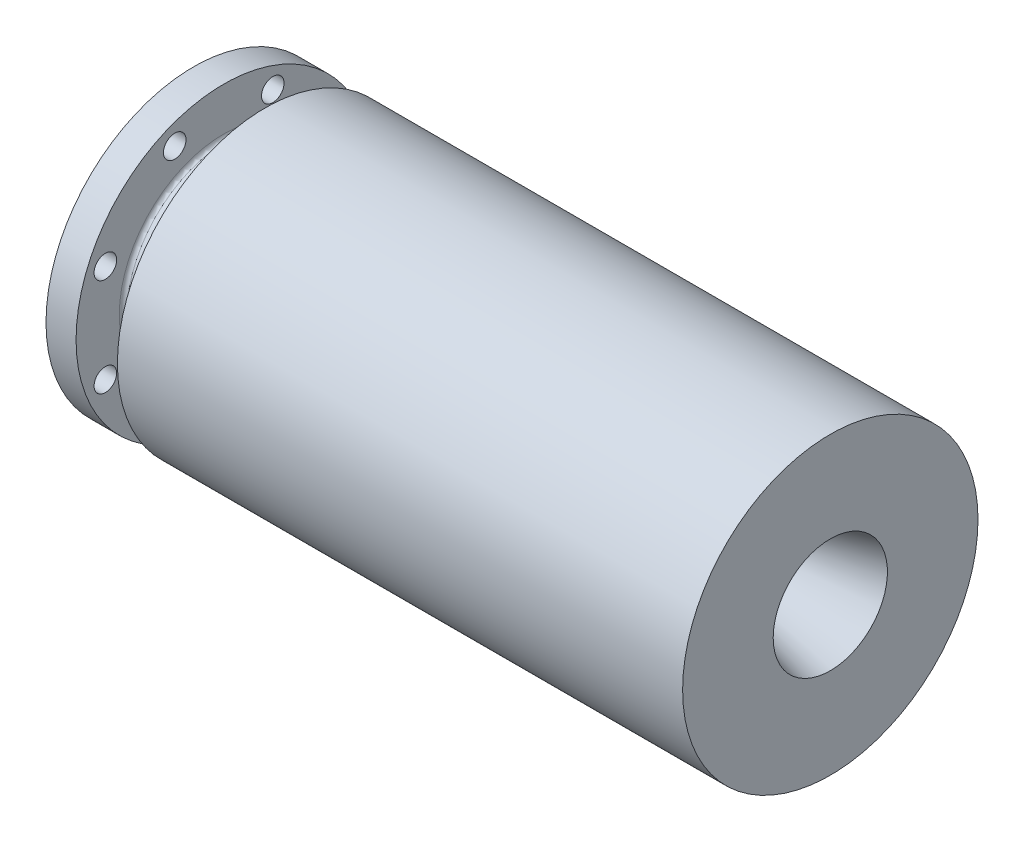
ISO-10303-21;
HEADER;
FILE_DESCRIPTION(('STEP AP214'),'2;1');
FILE_NAME('part.step','',(''),(''),'','','');
FILE_SCHEMA(('AUTOMOTIVE_DESIGN { 1 0 10303 214 1 1 1 1 }'));
ENDSEC;
DATA;
#1=APPLICATION_CONTEXT('core data for automotive mechanical design processes');
#2=APPLICATION_PROTOCOL_DEFINITION('international standard','automotive_design',2000,#1);
#3=PRODUCT_CONTEXT('',#1,'mechanical');
#4=PRODUCT('Part','Part','',(#3));
#5=PRODUCT_RELATED_PRODUCT_CATEGORY('part','',(#4));
#6=PRODUCT_DEFINITION_FORMATION('','',#4);
#7=PRODUCT_DEFINITION_CONTEXT('part definition',#1,'design');
#8=PRODUCT_DEFINITION('design','',#6,#7);
#9=PRODUCT_DEFINITION_SHAPE('','',#8);
#10=(LENGTH_UNIT() NAMED_UNIT(*) SI_UNIT(.MILLI.,.METRE.));
#11=(NAMED_UNIT(*) PLANE_ANGLE_UNIT() SI_UNIT($,.RADIAN.));
#12=(NAMED_UNIT(*) SI_UNIT($,.STERADIAN.) SOLID_ANGLE_UNIT());
#13=UNCERTAINTY_MEASURE_WITH_UNIT(LENGTH_MEASURE(1.E-05),#10,'distance_accuracy_value','');
#14=(GEOMETRIC_REPRESENTATION_CONTEXT(3) GLOBAL_UNCERTAINTY_ASSIGNED_CONTEXT((#13)) GLOBAL_UNIT_ASSIGNED_CONTEXT((#10,
#11,#12)) REPRESENTATION_CONTEXT('',''));
#15=CARTESIAN_POINT('',(0.,0.,0.));
#16=DIRECTION('',(0.,0.,1.));
#17=DIRECTION('',(1.,0.,0.));
#18=AXIS2_PLACEMENT_3D('',#15,#16,#17);
#19=CARTESIAN_POINT('',(0.,0.,0.));
#20=DIRECTION('',(-1.,0.,0.));
#21=DIRECTION('',(0.,0.,1.));
#22=AXIS2_PLACEMENT_3D('',#19,#20,#21);
#23=CYLINDRICAL_SURFACE('',#22,34.036);
#24=CARTESIAN_POINT('',(22.86,0.,0.));
#25=DIRECTION('',(1.,0.,0.));
#26=DIRECTION('',(0.,0.,-1.));
#27=AXIS2_PLACEMENT_3D('',#24,#25,#26);
#28=CIRCLE('',#27,34.036);
#29=CARTESIAN_POINT('',(22.86,0.,-34.036));
#30=VERTEX_POINT('',#29);
#31=EDGE_CURVE('E60',#30,#30,#28,.F.);
#32=ORIENTED_EDGE('',*,*,#31,.T.);
#33=EDGE_LOOP('',(#32));
#34=FACE_BOUND('',#33,.T.);
#35=CARTESIAN_POINT('',(11.43,0.,0.));
#36=DIRECTION('',(-1.,0.,0.));
#37=DIRECTION('',(0.,0.,1.));
#38=AXIS2_PLACEMENT_3D('',#35,#36,#37);
#39=CIRCLE('',#38,34.036);
#40=CARTESIAN_POINT('',(11.43,0.,34.036));
#41=VERTEX_POINT('',#40);
#42=EDGE_CURVE('E63',#41,#41,#39,.F.);
#43=ORIENTED_EDGE('',*,*,#42,.T.);
#44=EDGE_LOOP('',(#43));
#45=FACE_BOUND('',#44,.T.);
#46=ADVANCED_FACE('F34',(#34,#45),#23,.T.);
#47=CARTESIAN_POINT('',(10.16,49.911,0.));
#48=DIRECTION('',(-1.,0.,0.));
#49=DIRECTION('',(0.,0.,1.));
#50=AXIS2_PLACEMENT_3D('',#47,#48,#49);
#51=PLANE('',#50);
#52=CARTESIAN_POINT('',(10.16,40.0104509144663,16.572871405435));
#53=DIRECTION('',(-1.,0.,0.));
#54=DIRECTION('',(0.,0.,1.));
#55=AXIS2_PLACEMENT_3D('',#52,#53,#54);
#56=CIRCLE('',#55,3.81);
#57=CARTESIAN_POINT('',(10.16,40.0104509144663,20.382871405435));
#58=VERTEX_POINT('',#57);
#59=EDGE_CURVE('E103',#58,#58,#56,.F.);
#60=ORIENTED_EDGE('',*,*,#59,.F.);
#61=EDGE_LOOP('',(#60));
#62=FACE_BOUND('',#61,.T.);
#63=CARTESIAN_POINT('',(10.16,16.5728714054348,40.0104509144664));
#64=DIRECTION('',(-1.,0.,0.));
#65=DIRECTION('',(0.,0.,1.));
#66=AXIS2_PLACEMENT_3D('',#63,#64,#65);
#67=CIRCLE('',#66,3.81);
#68=CARTESIAN_POINT('',(10.16,16.5728714054348,43.8204509144664));
#69=VERTEX_POINT('',#68);
#70=EDGE_CURVE('E139',#69,#69,#67,.F.);
#71=ORIENTED_EDGE('',*,*,#70,.F.);
#72=EDGE_LOOP('',(#71));
#73=FACE_BOUND('',#72,.T.);
#74=CARTESIAN_POINT('',(10.16,-16.5728714054351,40.0104509144662));
#75=DIRECTION('',(-1.,0.,0.));
#76=DIRECTION('',(0.,0.,1.));
#77=AXIS2_PLACEMENT_3D('',#74,#75,#76);
#78=CIRCLE('',#77,3.81);
#79=CARTESIAN_POINT('',(10.16,-16.5728714054351,43.8204509144662));
#80=VERTEX_POINT('',#79);
#81=EDGE_CURVE('E133',#80,#80,#78,.F.);
#82=ORIENTED_EDGE('',*,*,#81,.F.);
#83=EDGE_LOOP('',(#82));
#84=FACE_BOUND('',#83,.T.);
#85=CARTESIAN_POINT('',(10.16,-40.0104509144663,16.572871405435));
#86=DIRECTION('',(-1.,0.,0.));
#87=DIRECTION('',(0.,0.,1.));
#88=AXIS2_PLACEMENT_3D('',#85,#86,#87);
#89=CIRCLE('',#88,3.81);
#90=CARTESIAN_POINT('',(10.16,-40.0104509144663,20.382871405435));
#91=VERTEX_POINT('',#90);
#92=EDGE_CURVE('E127',#91,#91,#89,.F.);
#93=ORIENTED_EDGE('',*,*,#92,.F.);
#94=EDGE_LOOP('',(#93));
#95=FACE_BOUND('',#94,.T.);
#96=CARTESIAN_POINT('',(10.16,-40.0104509144662,-16.5728714054353));
#97=DIRECTION('',(-1.,0.,0.));
#98=DIRECTION('',(0.,0.,1.));
#99=AXIS2_PLACEMENT_3D('',#96,#97,#98);
#100=CIRCLE('',#99,3.81);
#101=CARTESIAN_POINT('',(10.16,-40.0104509144662,-12.7628714054353));
#102=VERTEX_POINT('',#101);
#103=EDGE_CURVE('E121',#102,#102,#100,.F.);
#104=ORIENTED_EDGE('',*,*,#103,.F.);
#105=EDGE_LOOP('',(#104));
#106=FACE_BOUND('',#105,.T.);
#107=CARTESIAN_POINT('',(10.16,-16.5728714054346,-40.0104509144665));
#108=DIRECTION('',(-1.,0.,0.));
#109=DIRECTION('',(0.,0.,1.));
#110=AXIS2_PLACEMENT_3D('',#107,#108,#109);
#111=CIRCLE('',#110,3.81);
#112=CARTESIAN_POINT('',(10.16,-16.5728714054346,-36.2004509144665));
#113=VERTEX_POINT('',#112);
#114=EDGE_CURVE('E115',#113,#113,#111,.F.);
#115=ORIENTED_EDGE('',*,*,#114,.F.);
#116=EDGE_LOOP('',(#115));
#117=FACE_BOUND('',#116,.T.);
#118=CARTESIAN_POINT('',(10.16,16.5728714054354,-40.0104509144661));
#119=DIRECTION('',(-1.,0.,0.));
#120=DIRECTION('',(0.,0.,1.));
#121=AXIS2_PLACEMENT_3D('',#118,#119,#120);
#122=CIRCLE('',#121,3.81);
#123=CARTESIAN_POINT('',(10.16,16.5728714054354,-36.2004509144661));
#124=VERTEX_POINT('',#123);
#125=EDGE_CURVE('E109',#124,#124,#122,.F.);
#126=ORIENTED_EDGE('',*,*,#125,.F.);
#127=EDGE_LOOP('',(#126));
#128=FACE_BOUND('',#127,.T.);
#129=CARTESIAN_POINT('',(10.16,40.0104509144663,-16.572871405435));
#130=DIRECTION('',(-1.,0.,0.));
#131=DIRECTION('',(0.,0.,1.));
#132=AXIS2_PLACEMENT_3D('',#129,#130,#131);
#133=CIRCLE('',#132,3.81);
#134=CARTESIAN_POINT('',(10.16,40.0104509144663,-12.762871405435));
#135=VERTEX_POINT('',#134);
#136=EDGE_CURVE('E99',#135,#135,#133,.F.);
#137=ORIENTED_EDGE('',*,*,#136,.F.);
#138=EDGE_LOOP('',(#137));
#139=FACE_BOUND('',#138,.T.);
#140=CARTESIAN_POINT('',(10.16,0.,0.));
#141=DIRECTION('',(-1.,0.,0.));
#142=DIRECTION('',(0.,0.,1.));
#143=AXIS2_PLACEMENT_3D('',#140,#141,#142);
#144=CIRCLE('',#143,35.306);
#145=CARTESIAN_POINT('',(10.16,0.,35.306));
#146=VERTEX_POINT('',#145);
#147=EDGE_CURVE('E54',#146,#146,#144,.T.);
#148=ORIENTED_EDGE('',*,*,#147,.T.);
#149=EDGE_LOOP('',(#148));
#150=FACE_BOUND('',#149,.T.);
#151=CARTESIAN_POINT('',(10.16,0.,0.));
#152=DIRECTION('',(-1.,0.,0.));
#153=DIRECTION('',(0.,0.,1.));
#154=AXIS2_PLACEMENT_3D('',#151,#152,#153);
#155=CIRCLE('',#154,49.911);
#156=CARTESIAN_POINT('',(10.16,0.,49.911));
#157=VERTEX_POINT('',#156);
#158=EDGE_CURVE('E66',#157,#157,#155,.T.);
#159=ORIENTED_EDGE('',*,*,#158,.F.);
#160=EDGE_LOOP('',(#159));
#161=FACE_BOUND('',#160,.T.);
#162=ADVANCED_FACE('F150',(#62,#73,#84,#95,#106,#117,#128,#139,#150,#161),#51,.F.);
#163=CARTESIAN_POINT('',(0.,0.,0.));
#164=DIRECTION('',(-1.,0.,0.));
#165=DIRECTION('',(0.,0.,1.));
#166=AXIS2_PLACEMENT_3D('',#163,#164,#165);
#167=CYLINDRICAL_SURFACE('',#166,49.911);
#168=CARTESIAN_POINT('',(0.,0.,0.));
#169=DIRECTION('',(-1.,0.,0.));
#170=DIRECTION('',(0.,0.,1.));
#171=AXIS2_PLACEMENT_3D('',#168,#169,#170);
#172=CIRCLE('',#171,49.911);
#173=CARTESIAN_POINT('',(0.,0.,49.911));
#174=VERTEX_POINT('',#173);
#175=EDGE_CURVE('E69',#174,#174,#172,.T.);
#176=ORIENTED_EDGE('',*,*,#175,.F.);
#177=EDGE_LOOP('',(#176));
#178=FACE_BOUND('',#177,.T.);
#179=ORIENTED_EDGE('',*,*,#158,.T.);
#180=EDGE_LOOP('',(#179));
#181=FACE_BOUND('',#180,.T.);
#182=ADVANCED_FACE('F153',(#178,#181),#167,.T.);
#183=CARTESIAN_POINT('',(0.,37.5666,0.));
#184=DIRECTION('',(1.,0.,0.));
#185=DIRECTION('',(0.,0.,-1.));
#186=AXIS2_PLACEMENT_3D('',#183,#184,#185);
#187=PLANE('',#186);
#188=CARTESIAN_POINT('',(0.,40.0104509144663,16.572871405435));
#189=DIRECTION('',(-1.,0.,0.));
#190=DIRECTION('',(0.,-0.707106781186549,0.707106781186546));
#191=AXIS2_PLACEMENT_3D('',#188,#189,#190);
#192=CIRCLE('',#191,3.81);
#193=CARTESIAN_POINT('',(0.,37.3163740781455,19.2669482417557));
#194=VERTEX_POINT('',#193);
#195=EDGE_CURVE('E142',#194,#194,#192,.T.);
#196=ORIENTED_EDGE('',*,*,#195,.F.);
#197=EDGE_LOOP('',(#196));
#198=FACE_BOUND('',#197,.T.);
#199=CARTESIAN_POINT('',(0.,16.5728714054348,40.0104509144664));
#200=DIRECTION('',(-1.,0.,0.));
#201=DIRECTION('',(0.,-1.,0.));
#202=AXIS2_PLACEMENT_3D('',#199,#200,#201);
#203=CIRCLE('',#202,3.81);
#204=CARTESIAN_POINT('',(0.,12.7628714054348,40.0104509144663));
#205=VERTEX_POINT('',#204);
#206=EDGE_CURVE('E136',#205,#205,#203,.T.);
#207=ORIENTED_EDGE('',*,*,#206,.F.);
#208=EDGE_LOOP('',(#207));
#209=FACE_BOUND('',#208,.T.);
#210=CARTESIAN_POINT('',(0.,-16.5728714054351,40.0104509144662));
#211=DIRECTION('',(-1.,0.,0.));
#212=DIRECTION('',(0.,-0.707106781186544,-0.707106781186551));
#213=AXIS2_PLACEMENT_3D('',#210,#211,#212);
#214=CIRCLE('',#213,3.81);
#215=CARTESIAN_POINT('',(0.,-19.2669482417559,37.3163740781455));
#216=VERTEX_POINT('',#215);
#217=EDGE_CURVE('E130',#216,#216,#214,.T.);
#218=ORIENTED_EDGE('',*,*,#217,.F.);
#219=EDGE_LOOP('',(#218));
#220=FACE_BOUND('',#219,.T.);
#221=CARTESIAN_POINT('',(0.,-40.0104509144663,16.572871405435));
#222=DIRECTION('',(-1.,0.,0.));
#223=DIRECTION('',(0.,0.,-1.));
#224=AXIS2_PLACEMENT_3D('',#221,#222,#223);
#225=CIRCLE('',#224,3.81);
#226=CARTESIAN_POINT('',(0.,-40.0104509144663,12.762871405435));
#227=VERTEX_POINT('',#226);
#228=EDGE_CURVE('E124',#227,#227,#225,.T.);
#229=ORIENTED_EDGE('',*,*,#228,.F.);
#230=EDGE_LOOP('',(#229));
#231=FACE_BOUND('',#230,.T.);
#232=CARTESIAN_POINT('',(0.,-40.0104509144662,-16.5728714054353));
#233=DIRECTION('',(-1.,0.,0.));
#234=DIRECTION('',(0.,0.707106781186554,-0.707106781186541));
#235=AXIS2_PLACEMENT_3D('',#232,#233,#234);
#236=CIRCLE('',#235,3.81);
#237=CARTESIAN_POINT('',(0.,-37.3163740781454,-19.266948241756));
#238=VERTEX_POINT('',#237);
#239=EDGE_CURVE('E118',#238,#238,#236,.T.);
#240=ORIENTED_EDGE('',*,*,#239,.F.);
#241=EDGE_LOOP('',(#240));
#242=FACE_BOUND('',#241,.T.);
#243=CARTESIAN_POINT('',(0.,-16.5728714054346,-40.0104509144665));
#244=DIRECTION('',(-1.,0.,0.));
#245=DIRECTION('',(0.,1.,0.));
#246=AXIS2_PLACEMENT_3D('',#243,#244,#245);
#247=CIRCLE('',#246,3.81);
#248=CARTESIAN_POINT('',(0.,-12.7628714054346,-40.0104509144664));
#249=VERTEX_POINT('',#248);
#250=EDGE_CURVE('E112',#249,#249,#247,.T.);
#251=ORIENTED_EDGE('',*,*,#250,.F.);
#252=EDGE_LOOP('',(#251));
#253=FACE_BOUND('',#252,.T.);
#254=CARTESIAN_POINT('',(0.,16.5728714054354,-40.0104509144661));
#255=DIRECTION('',(-1.,0.,0.));
#256=DIRECTION('',(0.,0.707106781186539,0.707106781186556));
#257=AXIS2_PLACEMENT_3D('',#254,#255,#256);
#258=CIRCLE('',#257,3.81);
#259=CARTESIAN_POINT('',(0.,19.2669482417561,-37.3163740781453));
#260=VERTEX_POINT('',#259);
#261=EDGE_CURVE('E106',#260,#260,#258,.T.);
#262=ORIENTED_EDGE('',*,*,#261,.F.);
#263=EDGE_LOOP('',(#262));
#264=FACE_BOUND('',#263,.T.);
#265=CARTESIAN_POINT('',(0.,40.0104509144663,-16.572871405435));
#266=DIRECTION('',(-1.,0.,0.));
#267=DIRECTION('',(0.,0.,1.));
#268=AXIS2_PLACEMENT_3D('',#265,#266,#267);
#269=CIRCLE('',#268,3.81);
#270=CARTESIAN_POINT('',(0.,40.0104509144663,-12.762871405435));
#271=VERTEX_POINT('',#270);
#272=EDGE_CURVE('E100',#271,#271,#269,.T.);
#273=ORIENTED_EDGE('',*,*,#272,.F.);
#274=EDGE_LOOP('',(#273));
#275=FACE_BOUND('',#274,.T.);
#276=CARTESIAN_POINT('',(0.,0.,0.));
#277=DIRECTION('',(-1.,0.,0.));
#278=DIRECTION('',(0.,0.,1.));
#279=AXIS2_PLACEMENT_3D('',#276,#277,#278);
#280=CIRCLE('',#279,37.5666);
#281=CARTESIAN_POINT('',(0.,0.,37.5666));
#282=VERTEX_POINT('',#281);
#283=EDGE_CURVE('E72',#282,#282,#280,.T.);
#284=ORIENTED_EDGE('',*,*,#283,.F.);
#285=EDGE_LOOP('',(#284));
#286=FACE_BOUND('',#285,.T.);
#287=ORIENTED_EDGE('',*,*,#175,.T.);
#288=EDGE_LOOP('',(#287));
#289=FACE_BOUND('',#288,.T.);
#290=ADVANCED_FACE('F174',(#198,#209,#220,#231,#242,#253,#264,#275,#286,#289),#187,.F.);
#291=CARTESIAN_POINT('',(0.,0.,0.));
#292=DIRECTION('',(-1.,0.,0.));
#293=DIRECTION('',(0.,0.,1.));
#294=AXIS2_PLACEMENT_3D('',#291,#292,#293);
#295=CYLINDRICAL_SURFACE('',#294,37.5666);
#296=CARTESIAN_POINT('',(2.9718,0.,0.));
#297=DIRECTION('',(1.,0.,0.));
#298=DIRECTION('',(0.,0.,-1.));
#299=AXIS2_PLACEMENT_3D('',#296,#297,#298);
#300=CIRCLE('',#299,37.5666);
#301=CARTESIAN_POINT('',(2.9718,0.,-37.5666));
#302=VERTEX_POINT('',#301);
#303=EDGE_CURVE('E10',#302,#302,#300,.T.);
#304=ORIENTED_EDGE('',*,*,#303,.T.);
#305=EDGE_LOOP('',(#304));
#306=FACE_BOUND('',#305,.T.);
#307=ORIENTED_EDGE('',*,*,#283,.T.);
#308=EDGE_LOOP('',(#307));
#309=FACE_BOUND('',#308,.T.);
#310=ADVANCED_FACE('F180',(#306,#309),#295,.F.);
#311=CARTESIAN_POINT('',(3.8608,37.5666,0.));
#312=DIRECTION('',(1.,0.,0.));
#313=DIRECTION('',(0.,0.,-1.));
#314=AXIS2_PLACEMENT_3D('',#311,#312,#313);
#315=PLANE('',#314);
#316=CARTESIAN_POINT('',(3.8608,0.,0.));
#317=DIRECTION('',(1.,0.,0.));
#318=DIRECTION('',(0.,0.,-1.));
#319=AXIS2_PLACEMENT_3D('',#316,#317,#318);
#320=CIRCLE('',#319,32.385);
#321=CARTESIAN_POINT('',(3.8608,0.,-32.385));
#322=VERTEX_POINT('',#321);
#323=EDGE_CURVE('E41',#322,#322,#320,.T.);
#324=ORIENTED_EDGE('',*,*,#323,.T.);
#325=EDGE_LOOP('',(#324));
#326=FACE_BOUND('',#325,.T.);
#327=CARTESIAN_POINT('',(3.8608,0.,0.));
#328=DIRECTION('',(1.,0.,0.));
#329=DIRECTION('',(0.,0.,-1.));
#330=AXIS2_PLACEMENT_3D('',#327,#328,#329);
#331=CIRCLE('',#330,36.6776);
#332=CARTESIAN_POINT('',(3.8608,0.,-36.6776));
#333=VERTEX_POINT('',#332);
#334=EDGE_CURVE('E45',#333,#333,#331,.F.);
#335=ORIENTED_EDGE('',*,*,#334,.T.);
#336=EDGE_LOOP('',(#335));
#337=FACE_BOUND('',#336,.T.);
#338=ADVANCED_FACE('F218',(#326,#337),#315,.F.);
#339=CARTESIAN_POINT('',(0.,0.,0.));
#340=DIRECTION('',(-1.,0.,0.));
#341=DIRECTION('',(0.,0.,1.));
#342=AXIS2_PLACEMENT_3D('',#339,#340,#341);
#343=CYLINDRICAL_SURFACE('',#342,31.496);
#344=CARTESIAN_POINT('',(2.9718,0.,0.));
#345=DIRECTION('',(1.,0.,0.));
#346=DIRECTION('',(0.,0.,-1.));
#347=AXIS2_PLACEMENT_3D('',#344,#345,#346);
#348=CIRCLE('',#347,31.496);
#349=CARTESIAN_POINT('',(2.9718,0.,-31.496));
#350=VERTEX_POINT('',#349);
#351=EDGE_CURVE('E49',#350,#350,#348,.F.);
#352=ORIENTED_EDGE('',*,*,#351,.T.);
#353=EDGE_LOOP('',(#352));
#354=FACE_BOUND('',#353,.T.);
#355=CARTESIAN_POINT('',(0.,0.,0.));
#356=DIRECTION('',(-1.,0.,0.));
#357=DIRECTION('',(0.,0.,1.));
#358=AXIS2_PLACEMENT_3D('',#355,#356,#357);
#359=CIRCLE('',#358,31.496);
#360=CARTESIAN_POINT('',(0.,0.,31.496));
#361=VERTEX_POINT('',#360);
#362=EDGE_CURVE('E75',#361,#361,#359,.T.);
#363=ORIENTED_EDGE('',*,*,#362,.F.);
#364=EDGE_LOOP('',(#363));
#365=FACE_BOUND('',#364,.T.);
#366=ADVANCED_FACE('F214',(#354,#365),#343,.T.);
#367=CARTESIAN_POINT('',(0.,25.4,0.));
#368=DIRECTION('',(1.,0.,0.));
#369=DIRECTION('',(0.,0.,-1.));
#370=AXIS2_PLACEMENT_3D('',#367,#368,#369);
#371=PLANE('',#370);
#372=CARTESIAN_POINT('',(0.,0.,0.));
#373=DIRECTION('',(-1.,0.,0.));
#374=DIRECTION('',(0.,0.,1.));
#375=AXIS2_PLACEMENT_3D('',#372,#373,#374);
#376=CIRCLE('',#375,25.4);
#377=CARTESIAN_POINT('',(0.,0.,25.4));
#378=VERTEX_POINT('',#377);
#379=EDGE_CURVE('E78',#378,#378,#376,.T.);
#380=ORIENTED_EDGE('',*,*,#379,.F.);
#381=EDGE_LOOP('',(#380));
#382=FACE_BOUND('',#381,.T.);
#383=ORIENTED_EDGE('',*,*,#362,.T.);
#384=EDGE_LOOP('',(#383));
#385=FACE_BOUND('',#384,.T.);
#386=ADVANCED_FACE('F217',(#382,#385),#371,.F.);
#387=CARTESIAN_POINT('',(0.,0.,0.));
#388=DIRECTION('',(-1.,0.,0.));
#389=DIRECTION('',(0.,0.,1.));
#390=AXIS2_PLACEMENT_3D('',#387,#388,#389);
#391=CYLINDRICAL_SURFACE('',#390,25.4);
#392=CARTESIAN_POINT('',(177.8,0.,0.));
#393=DIRECTION('',(-1.,0.,0.));
#394=DIRECTION('',(0.,0.,1.));
#395=AXIS2_PLACEMENT_3D('',#392,#393,#394);
#396=CIRCLE('',#395,25.4);
#397=CARTESIAN_POINT('',(177.8,0.,25.4));
#398=VERTEX_POINT('',#397);
#399=EDGE_CURVE('E81',#398,#398,#396,.T.);
#400=ORIENTED_EDGE('',*,*,#399,.F.);
#401=EDGE_LOOP('',(#400));
#402=FACE_BOUND('',#401,.T.);
#403=ORIENTED_EDGE('',*,*,#379,.T.);
#404=EDGE_LOOP('',(#403));
#405=FACE_BOUND('',#404,.T.);
#406=ADVANCED_FACE('F223',(#402,#405),#391,.F.);
#407=CARTESIAN_POINT('',(177.8,0.,0.));
#408=DIRECTION('',(-1.,0.,0.));
#409=DIRECTION('',(0.,0.,1.));
#410=AXIS2_PLACEMENT_3D('',#407,#408,#409);
#411=CONICAL_SURFACE('',#410,25.4,0.785398163397442);
#412=CARTESIAN_POINT('',(189.463049342222,0.,0.));
#413=DIRECTION('',(-1.,0.,0.));
#414=DIRECTION('',(0.,0.,1.));
#415=AXIS2_PLACEMENT_3D('',#412,#413,#414);
#416=CIRCLE('',#415,13.7369506577782);
#417=CARTESIAN_POINT('',(189.463049342222,0.,13.7369506577782));
#418=VERTEX_POINT('',#417);
#419=EDGE_CURVE('E84',#418,#418,#416,.T.);
#420=ORIENTED_EDGE('',*,*,#419,.F.);
#421=EDGE_LOOP('',(#420));
#422=FACE_BOUND('',#421,.T.);
#423=ORIENTED_EDGE('',*,*,#399,.T.);
#424=EDGE_LOOP('',(#423));
#425=FACE_BOUND('',#424,.T.);
#426=ADVANCED_FACE('F229',(#422,#425),#411,.F.);
#427=CARTESIAN_POINT('',(191.259100566436,0.,0.));
#428=DIRECTION('',(-1.,0.,0.));
#429=DIRECTION('',(0.,0.,1.));
#430=AXIS2_PLACEMENT_3D('',#427,#428,#429);
#431=TOROIDAL_SURFACE('',#430,15.533001881992,2.54);
#432=CARTESIAN_POINT('',(191.916500940996,0.,0.));
#433=DIRECTION('',(-1.,0.,0.));
#434=DIRECTION('',(0.,0.,1.));
#435=AXIS2_PLACEMENT_3D('',#432,#433,#434);
#436=CIRCLE('',#435,13.0795502832178);
#437=CARTESIAN_POINT('',(191.916500940996,0.,13.0795502832178));
#438=VERTEX_POINT('',#437);
#439=EDGE_CURVE('E87',#438,#438,#436,.T.);
#440=ORIENTED_EDGE('',*,*,#439,.F.);
#441=EDGE_LOOP('',(#440));
#442=FACE_BOUND('',#441,.T.);
#443=ORIENTED_EDGE('',*,*,#419,.T.);
#444=EDGE_LOOP('',(#443));
#445=FACE_BOUND('',#444,.T.);
#446=ADVANCED_FACE('F280',(#442,#445),#431,.T.);
#447=CARTESIAN_POINT('',(191.916500940996,0.,0.));
#448=DIRECTION('',(1.,0.,0.));
#449=DIRECTION('',(0.,0.,-1.));
#450=AXIS2_PLACEMENT_3D('',#447,#448,#449);
#451=CONICAL_SURFACE('',#450,13.0795502832178,0.26179938779915);
#452=CARTESIAN_POINT('',(215.146463533185,0.,0.));
#453=DIRECTION('',(-1.,0.,0.));
#454=DIRECTION('',(0.,0.,1.));
#455=AXIS2_PLACEMENT_3D('',#452,#453,#454);
#456=CIRCLE('',#455,19.304);
#457=CARTESIAN_POINT('',(215.146463533185,0.,19.304));
#458=VERTEX_POINT('',#457);
#459=EDGE_CURVE('E90',#458,#458,#456,.T.);
#460=ORIENTED_EDGE('',*,*,#459,.F.);
#461=EDGE_LOOP('',(#460));
#462=FACE_BOUND('',#461,.T.);
#463=ORIENTED_EDGE('',*,*,#439,.T.);
#464=EDGE_LOOP('',(#463));
#465=FACE_BOUND('',#464,.T.);
#466=ADVANCED_FACE('F290',(#462,#465),#451,.F.);
#467=CARTESIAN_POINT('',(215.146463533185,49.911,0.));
#468=DIRECTION('',(-1.,0.,0.));
#469=DIRECTION('',(0.,0.,1.));
#470=AXIS2_PLACEMENT_3D('',#467,#468,#469);
#471=PLANE('',#470);
#472=CARTESIAN_POINT('',(215.146463533185,0.,0.));
#473=DIRECTION('',(-1.,0.,0.));
#474=DIRECTION('',(0.,0.,1.));
#475=AXIS2_PLACEMENT_3D('',#472,#473,#474);
#476=CIRCLE('',#475,49.911);
#477=CARTESIAN_POINT('',(215.146463533185,0.,49.911));
#478=VERTEX_POINT('',#477);
#479=EDGE_CURVE('E93',#478,#478,#476,.T.);
#480=ORIENTED_EDGE('',*,*,#479,.F.);
#481=EDGE_LOOP('',(#480));
#482=FACE_BOUND('',#481,.T.);
#483=ORIENTED_EDGE('',*,*,#459,.T.);
#484=EDGE_LOOP('',(#483));
#485=FACE_BOUND('',#484,.T.);
#486=ADVANCED_FACE('F301',(#482,#485),#471,.F.);
#487=CARTESIAN_POINT('',(0.,0.,0.));
#488=DIRECTION('',(-1.,0.,0.));
#489=DIRECTION('',(0.,0.,1.));
#490=AXIS2_PLACEMENT_3D('',#487,#488,#489);
#491=CYLINDRICAL_SURFACE('',#490,49.911);
#492=CARTESIAN_POINT('',(24.13,0.,0.));
#493=DIRECTION('',(-1.,0.,0.));
#494=DIRECTION('',(0.,0.,1.));
#495=AXIS2_PLACEMENT_3D('',#492,#493,#494);
#496=CIRCLE('',#495,49.911);
#497=CARTESIAN_POINT('',(24.13,0.,49.911));
#498=VERTEX_POINT('',#497);
#499=EDGE_CURVE('E96',#498,#498,#496,.T.);
#500=ORIENTED_EDGE('',*,*,#499,.F.);
#501=EDGE_LOOP('',(#500));
#502=FACE_BOUND('',#501,.T.);
#503=ORIENTED_EDGE('',*,*,#479,.T.);
#504=EDGE_LOOP('',(#503));
#505=FACE_BOUND('',#504,.T.);
#506=ADVANCED_FACE('F312',(#502,#505),#491,.T.);
#507=CARTESIAN_POINT('',(24.13,34.036,0.));
#508=DIRECTION('',(1.,0.,0.));
#509=DIRECTION('',(0.,0.,-1.));
#510=AXIS2_PLACEMENT_3D('',#507,#508,#509);
#511=PLANE('',#510);
#512=CARTESIAN_POINT('',(24.13,0.,0.));
#513=DIRECTION('',(1.,0.,0.));
#514=DIRECTION('',(0.,0.,-1.));
#515=AXIS2_PLACEMENT_3D('',#512,#513,#514);
#516=CIRCLE('',#515,35.306);
#517=CARTESIAN_POINT('',(24.13,0.,-35.306));
#518=VERTEX_POINT('',#517);
#519=EDGE_CURVE('E57',#518,#518,#516,.T.);
#520=ORIENTED_EDGE('',*,*,#519,.T.);
#521=EDGE_LOOP('',(#520));
#522=FACE_BOUND('',#521,.T.);
#523=ORIENTED_EDGE('',*,*,#499,.T.);
#524=EDGE_LOOP('',(#523));
#525=FACE_BOUND('',#524,.T.);
#526=ADVANCED_FACE('F195',(#522,#525),#511,.F.);
#527=CARTESIAN_POINT('',(22.86,0.,0.));
#528=DIRECTION('',(1.,0.,0.));
#529=DIRECTION('',(0.,0.,-1.));
#530=AXIS2_PLACEMENT_3D('',#527,#528,#529);
#531=TOROIDAL_SURFACE('',#530,35.306,1.27);
#532=ORIENTED_EDGE('',*,*,#519,.F.);
#533=EDGE_LOOP('',(#532));
#534=FACE_BOUND('',#533,.T.);
#535=ORIENTED_EDGE('',*,*,#31,.F.);
#536=EDGE_LOOP('',(#535));
#537=FACE_BOUND('',#536,.T.);
#538=ADVANCED_FACE('F191',(#534,#537),#531,.F.);
#539=CARTESIAN_POINT('',(11.43,0.,0.));
#540=DIRECTION('',(-1.,0.,0.));
#541=DIRECTION('',(0.,0.,1.));
#542=AXIS2_PLACEMENT_3D('',#539,#540,#541);
#543=TOROIDAL_SURFACE('',#542,35.306,1.27);
#544=ORIENTED_EDGE('',*,*,#42,.F.);
#545=EDGE_LOOP('',(#544));
#546=FACE_BOUND('',#545,.T.);
#547=ORIENTED_EDGE('',*,*,#147,.F.);
#548=EDGE_LOOP('',(#547));
#549=FACE_BOUND('',#548,.T.);
#550=ADVANCED_FACE('F194',(#546,#549),#543,.F.);
#551=CARTESIAN_POINT('',(215.147463533185,40.0104509144663,-16.572871405435));
#552=DIRECTION('',(-1.,0.,0.));
#553=DIRECTION('',(0.,0.,1.));
#554=AXIS2_PLACEMENT_3D('',#551,#552,#553);
#555=CYLINDRICAL_SURFACE('',#554,3.81);
#556=ORIENTED_EDGE('',*,*,#272,.T.);
#557=EDGE_LOOP('',(#556));
#558=FACE_BOUND('',#557,.T.);
#559=ORIENTED_EDGE('',*,*,#136,.T.);
#560=EDGE_LOOP('',(#559));
#561=FACE_BOUND('',#560,.T.);
#562=ADVANCED_FACE('F198',(#558,#561),#555,.F.);
#563=CARTESIAN_POINT('',(215.147463533185,16.5728714054354,-40.0104509144661));
#564=DIRECTION('',(-1.,0.,0.));
#565=DIRECTION('',(0.,0.,1.));
#566=AXIS2_PLACEMENT_3D('',#563,#564,#565);
#567=CYLINDRICAL_SURFACE('',#566,3.81);
#568=ORIENTED_EDGE('',*,*,#261,.T.);
#569=EDGE_LOOP('',(#568));
#570=FACE_BOUND('',#569,.T.);
#571=ORIENTED_EDGE('',*,*,#125,.T.);
#572=EDGE_LOOP('',(#571));
#573=FACE_BOUND('',#572,.T.);
#574=ADVANCED_FACE('F359',(#570,#573),#567,.F.);
#575=CARTESIAN_POINT('',(215.147463533185,-16.5728714054346,-40.0104509144665));
#576=DIRECTION('',(-1.,0.,0.));
#577=DIRECTION('',(0.,0.,1.));
#578=AXIS2_PLACEMENT_3D('',#575,#576,#577);
#579=CYLINDRICAL_SURFACE('',#578,3.81);
#580=ORIENTED_EDGE('',*,*,#250,.T.);
#581=EDGE_LOOP('',(#580));
#582=FACE_BOUND('',#581,.T.);
#583=ORIENTED_EDGE('',*,*,#114,.T.);
#584=EDGE_LOOP('',(#583));
#585=FACE_BOUND('',#584,.T.);
#586=ADVANCED_FACE('F370',(#582,#585),#579,.F.);
#587=CARTESIAN_POINT('',(215.147463533185,-40.0104509144662,-16.5728714054353));
#588=DIRECTION('',(-1.,0.,0.));
#589=DIRECTION('',(0.,0.,1.));
#590=AXIS2_PLACEMENT_3D('',#587,#588,#589);
#591=CYLINDRICAL_SURFACE('',#590,3.81);
#592=ORIENTED_EDGE('',*,*,#239,.T.);
#593=EDGE_LOOP('',(#592));
#594=FACE_BOUND('',#593,.T.);
#595=ORIENTED_EDGE('',*,*,#103,.T.);
#596=EDGE_LOOP('',(#595));
#597=FACE_BOUND('',#596,.T.);
#598=ADVANCED_FACE('F381',(#594,#597),#591,.F.);
#599=CARTESIAN_POINT('',(215.147463533185,-40.0104509144663,16.572871405435));
#600=DIRECTION('',(-1.,0.,0.));
#601=DIRECTION('',(0.,0.,1.));
#602=AXIS2_PLACEMENT_3D('',#599,#600,#601);
#603=CYLINDRICAL_SURFACE('',#602,3.81);
#604=ORIENTED_EDGE('',*,*,#228,.T.);
#605=EDGE_LOOP('',(#604));
#606=FACE_BOUND('',#605,.T.);
#607=ORIENTED_EDGE('',*,*,#92,.T.);
#608=EDGE_LOOP('',(#607));
#609=FACE_BOUND('',#608,.T.);
#610=ADVANCED_FACE('F392',(#606,#609),#603,.F.);
#611=CARTESIAN_POINT('',(215.147463533185,-16.5728714054351,40.0104509144662));
#612=DIRECTION('',(-1.,0.,0.));
#613=DIRECTION('',(0.,0.,1.));
#614=AXIS2_PLACEMENT_3D('',#611,#612,#613);
#615=CYLINDRICAL_SURFACE('',#614,3.81);
#616=ORIENTED_EDGE('',*,*,#217,.T.);
#617=EDGE_LOOP('',(#616));
#618=FACE_BOUND('',#617,.T.);
#619=ORIENTED_EDGE('',*,*,#81,.T.);
#620=EDGE_LOOP('',(#619));
#621=FACE_BOUND('',#620,.T.);
#622=ADVANCED_FACE('F403',(#618,#621),#615,.F.);
#623=CARTESIAN_POINT('',(215.147463533185,16.5728714054348,40.0104509144664));
#624=DIRECTION('',(-1.,0.,0.));
#625=DIRECTION('',(0.,0.,1.));
#626=AXIS2_PLACEMENT_3D('',#623,#624,#625);
#627=CYLINDRICAL_SURFACE('',#626,3.81);
#628=ORIENTED_EDGE('',*,*,#206,.T.);
#629=EDGE_LOOP('',(#628));
#630=FACE_BOUND('',#629,.T.);
#631=ORIENTED_EDGE('',*,*,#70,.T.);
#632=EDGE_LOOP('',(#631));
#633=FACE_BOUND('',#632,.T.);
#634=ADVANCED_FACE('F208',(#630,#633),#627,.F.);
#635=CARTESIAN_POINT('',(215.147463533185,40.0104509144663,16.572871405435));
#636=DIRECTION('',(-1.,0.,0.));
#637=DIRECTION('',(0.,0.,1.));
#638=AXIS2_PLACEMENT_3D('',#635,#636,#637);
#639=CYLINDRICAL_SURFACE('',#638,3.81);
#640=ORIENTED_EDGE('',*,*,#195,.T.);
#641=EDGE_LOOP('',(#640));
#642=FACE_BOUND('',#641,.T.);
#643=ORIENTED_EDGE('',*,*,#59,.T.);
#644=EDGE_LOOP('',(#643));
#645=FACE_BOUND('',#644,.T.);
#646=ADVANCED_FACE('F148',(#642,#645),#639,.F.);
#647=CARTESIAN_POINT('',(2.9718,0.,0.));
#648=DIRECTION('',(1.,0.,0.));
#649=DIRECTION('',(0.,0.,-1.));
#650=AXIS2_PLACEMENT_3D('',#647,#648,#649);
#651=TOROIDAL_SURFACE('',#650,32.385,0.889);
#652=ORIENTED_EDGE('',*,*,#323,.F.);
#653=EDGE_LOOP('',(#652));
#654=FACE_BOUND('',#653,.T.);
#655=ORIENTED_EDGE('',*,*,#351,.F.);
#656=EDGE_LOOP('',(#655));
#657=FACE_BOUND('',#656,.T.);
#658=ADVANCED_FACE('F200',(#654,#657),#651,.F.);
#659=CARTESIAN_POINT('',(2.9718,0.,0.));
#660=DIRECTION('',(1.,0.,0.));
#661=DIRECTION('',(0.,0.,-1.));
#662=AXIS2_PLACEMENT_3D('',#659,#660,#661);
#663=TOROIDAL_SURFACE('',#662,36.6776,0.889);
#664=ORIENTED_EDGE('',*,*,#303,.F.);
#665=EDGE_LOOP('',(#664));
#666=FACE_BOUND('',#665,.T.);
#667=ORIENTED_EDGE('',*,*,#334,.F.);
#668=EDGE_LOOP('',(#667));
#669=FACE_BOUND('',#668,.T.);
#670=ADVANCED_FACE('F36',(#666,#669),#663,.F.);
#671=CLOSED_SHELL('',(#46,#162,#182,#290,#310,#338,#366,#386,#406,#426,#446,#466,#486,#506,#526,
#538,#550,#562,#574,#586,#598,#610,#622,#634,#646,#658,#670));
#672=MANIFOLD_SOLID_BREP('B2',#671);
#673=ADVANCED_BREP_SHAPE_REPRESENTATION('',(#18,#672),#14);
#674=SHAPE_DEFINITION_REPRESENTATION(#9,#673);
ENDSEC;
END-ISO-10303-21;
